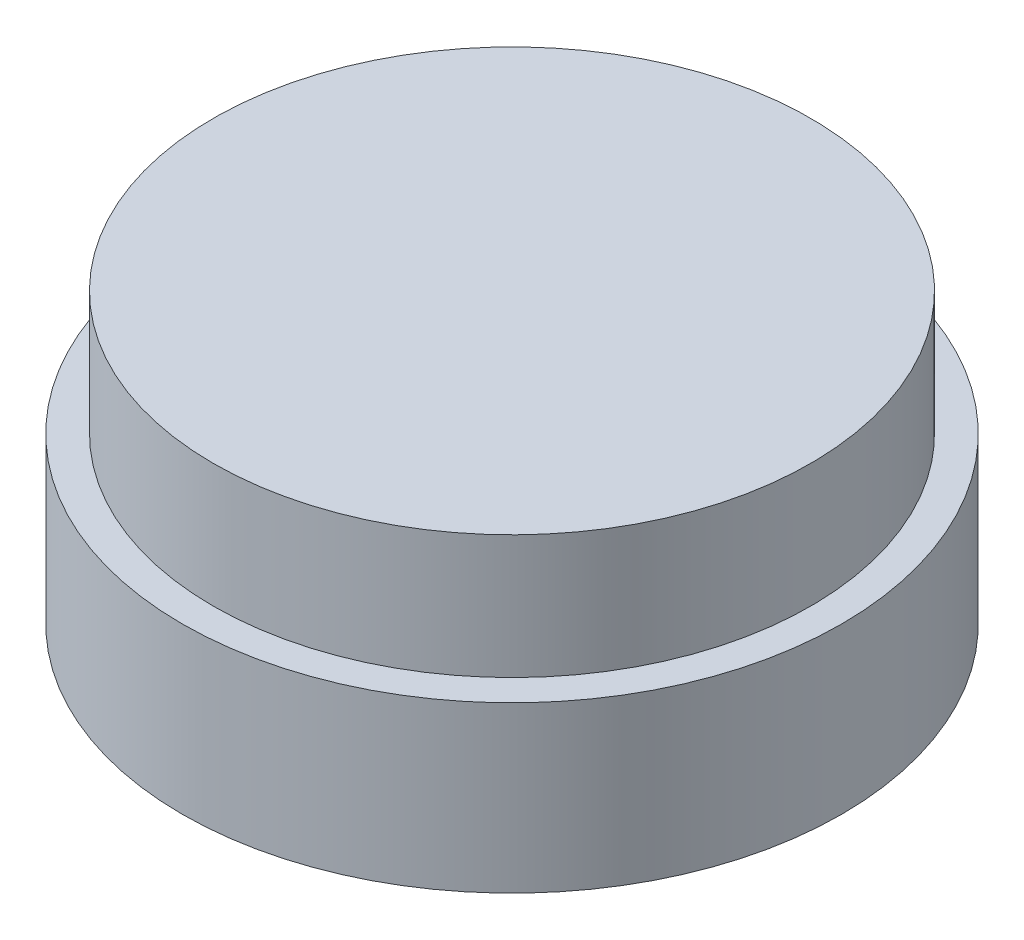
ISO-10303-21;
HEADER;
FILE_DESCRIPTION(('STEP AP214'),'2;1');
FILE_NAME('part.step','',(''),(''),'','','');
FILE_SCHEMA(('AUTOMOTIVE_DESIGN { 1 0 10303 214 1 1 1 1 }'));
ENDSEC;
DATA;
#1=APPLICATION_CONTEXT('core data for automotive mechanical design processes');
#2=APPLICATION_PROTOCOL_DEFINITION('international standard','automotive_design',2000,#1);
#3=PRODUCT_CONTEXT('',#1,'mechanical');
#4=PRODUCT('Part','Part','',(#3));
#5=PRODUCT_RELATED_PRODUCT_CATEGORY('part','',(#4));
#6=PRODUCT_DEFINITION_FORMATION('','',#4);
#7=PRODUCT_DEFINITION_CONTEXT('part definition',#1,'design');
#8=PRODUCT_DEFINITION('design','',#6,#7);
#9=PRODUCT_DEFINITION_SHAPE('','',#8);
#10=(LENGTH_UNIT() NAMED_UNIT(*) SI_UNIT(.MILLI.,.METRE.));
#11=(NAMED_UNIT(*) PLANE_ANGLE_UNIT() SI_UNIT($,.RADIAN.));
#12=(NAMED_UNIT(*) SI_UNIT($,.STERADIAN.) SOLID_ANGLE_UNIT());
#13=UNCERTAINTY_MEASURE_WITH_UNIT(LENGTH_MEASURE(1.E-05),#10,'distance_accuracy_value','');
#14=(GEOMETRIC_REPRESENTATION_CONTEXT(3) GLOBAL_UNCERTAINTY_ASSIGNED_CONTEXT((#13)) GLOBAL_UNIT_ASSIGNED_CONTEXT((#10,
#11,#12)) REPRESENTATION_CONTEXT('',''));
#15=CARTESIAN_POINT('',(0.,0.,0.));
#16=DIRECTION('',(0.,0.,1.));
#17=DIRECTION('',(1.,0.,0.));
#18=AXIS2_PLACEMENT_3D('',#15,#16,#17);
#19=CARTESIAN_POINT('',(0.,4.,0.));
#20=DIRECTION('',(0.,-1.,0.));
#21=DIRECTION('',(0.,0.,-1.));
#22=AXIS2_PLACEMENT_3D('',#19,#20,#21);
#23=CYLINDRICAL_SURFACE('',#22,8.);
#24=CARTESIAN_POINT('',(0.,4.,0.));
#25=DIRECTION('',(0.,1.,0.));
#26=DIRECTION('',(0.,0.,1.));
#27=AXIS2_PLACEMENT_3D('',#24,#25,#26);
#28=CIRCLE('',#27,8.);
#29=CARTESIAN_POINT('',(0.,4.,8.));
#30=VERTEX_POINT('',#29);
#31=EDGE_CURVE('E61',#30,#30,#28,.T.);
#32=ORIENTED_EDGE('',*,*,#31,.F.);
#33=EDGE_LOOP('',(#32));
#34=FACE_BOUND('',#33,.T.);
#35=CARTESIAN_POINT('',(0.,0.,0.));
#36=DIRECTION('',(0.,1.,0.));
#37=DIRECTION('',(0.,0.,1.));
#38=AXIS2_PLACEMENT_3D('',#35,#36,#37);
#39=CIRCLE('',#38,8.);
#40=CARTESIAN_POINT('',(0.,0.,8.));
#41=VERTEX_POINT('',#40);
#42=EDGE_CURVE('E56',#41,#41,#39,.T.);
#43=ORIENTED_EDGE('',*,*,#42,.T.);
#44=EDGE_LOOP('',(#43));
#45=FACE_BOUND('',#44,.T.);
#46=ADVANCED_FACE('F53',(#34,#45),#23,.T.);
#47=CARTESIAN_POINT('',(0.,4.,0.));
#48=DIRECTION('',(0.,1.,0.));
#49=DIRECTION('',(0.,0.,1.));
#50=AXIS2_PLACEMENT_3D('',#47,#48,#49);
#51=PLANE('',#50);
#52=CARTESIAN_POINT('',(0.,4.,0.));
#53=DIRECTION('',(0.,1.,0.));
#54=DIRECTION('',(0.,0.,1.));
#55=AXIS2_PLACEMENT_3D('',#52,#53,#54);
#56=CIRCLE('',#55,7.25);
#57=CARTESIAN_POINT('',(0.,4.,7.25));
#58=VERTEX_POINT('',#57);
#59=EDGE_CURVE('E12',#58,#58,#56,.T.);
#60=ORIENTED_EDGE('',*,*,#59,.F.);
#61=EDGE_LOOP('',(#60));
#62=FACE_BOUND('',#61,.T.);
#63=ORIENTED_EDGE('',*,*,#31,.T.);
#64=EDGE_LOOP('',(#63));
#65=FACE_BOUND('',#64,.T.);
#66=ADVANCED_FACE('F87',(#62,#65),#51,.T.);
#67=CARTESIAN_POINT('',(0.,0.,0.));
#68=DIRECTION('',(0.,1.,0.));
#69=DIRECTION('',(0.,0.,1.));
#70=AXIS2_PLACEMENT_3D('',#67,#68,#69);
#71=PLANE('',#70);
#72=ORIENTED_EDGE('',*,*,#42,.F.);
#73=EDGE_LOOP('',(#72));
#74=FACE_BOUND('',#73,.T.);
#75=ADVANCED_FACE('F84',(#74),#71,.F.);
#76=CARTESIAN_POINT('',(0.,7.,0.));
#77=DIRECTION('',(0.,-1.,0.));
#78=DIRECTION('',(0.,0.,-1.));
#79=AXIS2_PLACEMENT_3D('',#76,#77,#78);
#80=CYLINDRICAL_SURFACE('',#79,7.25);
#81=CARTESIAN_POINT('',(0.,7.,0.));
#82=DIRECTION('',(0.,1.,0.));
#83=DIRECTION('',(0.,0.,1.));
#84=AXIS2_PLACEMENT_3D('',#81,#82,#83);
#85=CIRCLE('',#84,7.25);
#86=CARTESIAN_POINT('',(0.,7.,7.25));
#87=VERTEX_POINT('',#86);
#88=EDGE_CURVE('E70',#87,#87,#85,.T.);
#89=ORIENTED_EDGE('',*,*,#88,.F.);
#90=EDGE_LOOP('',(#89));
#91=FACE_BOUND('',#90,.T.);
#92=ORIENTED_EDGE('',*,*,#59,.T.);
#93=EDGE_LOOP('',(#92));
#94=FACE_BOUND('',#93,.T.);
#95=ADVANCED_FACE('F86',(#91,#94),#80,.T.);
#96=CARTESIAN_POINT('',(0.,7.,0.));
#97=DIRECTION('',(0.,1.,0.));
#98=DIRECTION('',(0.,0.,1.));
#99=AXIS2_PLACEMENT_3D('',#96,#97,#98);
#100=PLANE('',#99);
#101=ORIENTED_EDGE('',*,*,#88,.T.);
#102=EDGE_LOOP('',(#101));
#103=FACE_BOUND('',#102,.T.);
#104=ADVANCED_FACE('F92',(#103),#100,.T.);
#105=CLOSED_SHELL('',(#46,#66,#75,#95,#104));
#106=MANIFOLD_SOLID_BREP('B2',#105);
#107=ADVANCED_BREP_SHAPE_REPRESENTATION('',(#18,#106),#14);
#108=SHAPE_DEFINITION_REPRESENTATION(#9,#107);
ENDSEC;
END-ISO-10303-21;
